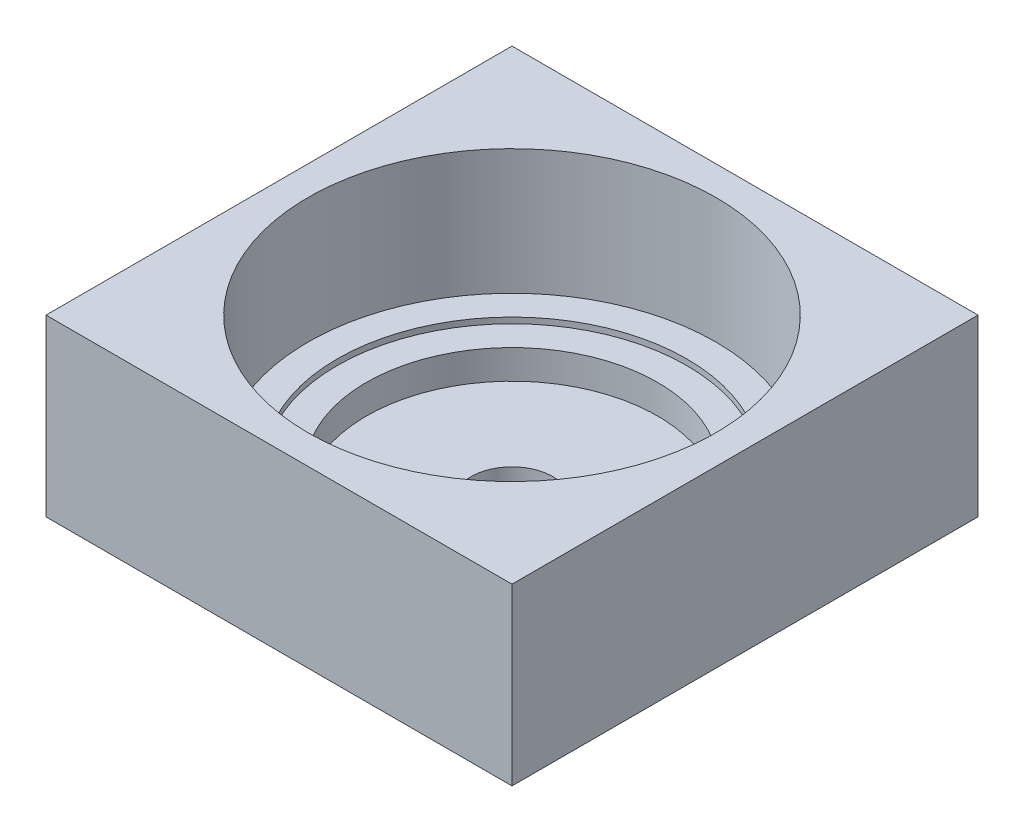
ISO-10303-21;
HEADER;
FILE_DESCRIPTION(('STEP AP214'),'2;1');
FILE_NAME('part.step','',(''),(''),'','','');
FILE_SCHEMA(('AUTOMOTIVE_DESIGN { 1 0 10303 214 1 1 1 1 }'));
ENDSEC;
DATA;
#1=APPLICATION_CONTEXT('core data for automotive mechanical design processes');
#2=APPLICATION_PROTOCOL_DEFINITION('international standard','automotive_design',2000,#1);
#3=PRODUCT_CONTEXT('',#1,'mechanical');
#4=PRODUCT('Part','Part','',(#3));
#5=PRODUCT_RELATED_PRODUCT_CATEGORY('part','',(#4));
#6=PRODUCT_DEFINITION_FORMATION('','',#4);
#7=PRODUCT_DEFINITION_CONTEXT('part definition',#1,'design');
#8=PRODUCT_DEFINITION('design','',#6,#7);
#9=PRODUCT_DEFINITION_SHAPE('','',#8);
#10=(LENGTH_UNIT() NAMED_UNIT(*) SI_UNIT(.MILLI.,.METRE.));
#11=(NAMED_UNIT(*) PLANE_ANGLE_UNIT() SI_UNIT($,.RADIAN.));
#12=(NAMED_UNIT(*) SI_UNIT($,.STERADIAN.) SOLID_ANGLE_UNIT());
#13=UNCERTAINTY_MEASURE_WITH_UNIT(LENGTH_MEASURE(1.E-05),#10,'distance_accuracy_value','');
#14=(GEOMETRIC_REPRESENTATION_CONTEXT(3) GLOBAL_UNCERTAINTY_ASSIGNED_CONTEXT((#13)) GLOBAL_UNIT_ASSIGNED_CONTEXT((#10,
#11,#12)) REPRESENTATION_CONTEXT('',''));
#15=CARTESIAN_POINT('',(0.,0.,0.));
#16=DIRECTION('',(0.,0.,1.));
#17=DIRECTION('',(1.,0.,0.));
#18=AXIS2_PLACEMENT_3D('',#15,#16,#17);
#19=CARTESIAN_POINT('',(80.,60.,80.));
#20=DIRECTION('',(-1.,0.,0.));
#21=DIRECTION('',(0.,0.,1.));
#22=AXIS2_PLACEMENT_3D('',#19,#20,#21);
#23=PLANE('',#22);
#24=DIRECTION('',(0.,0.,-1.));
#25=VECTOR('',#24,1.);
#26=CARTESIAN_POINT('',(80.,0.,80.));
#27=LINE('',#26,#25);
#28=CARTESIAN_POINT('',(80.,0.,80.));
#29=VERTEX_POINT('',#28);
#30=CARTESIAN_POINT('',(80.,0.,-80.));
#31=VERTEX_POINT('',#30);
#32=EDGE_CURVE('E96',#29,#31,#27,.T.);
#33=ORIENTED_EDGE('',*,*,#32,.T.);
#34=DIRECTION('',(0.,-1.,0.));
#35=VECTOR('',#34,1.);
#36=CARTESIAN_POINT('',(80.,60.,-80.));
#37=LINE('',#36,#35);
#38=CARTESIAN_POINT('',(80.,60.,-80.));
#39=VERTEX_POINT('',#38);
#40=EDGE_CURVE('E11',#39,#31,#37,.T.);
#41=ORIENTED_EDGE('',*,*,#40,.F.);
#42=DIRECTION('',(0.,0.,-1.));
#43=VECTOR('',#42,1.);
#44=CARTESIAN_POINT('',(80.,60.,80.));
#45=LINE('',#44,#43);
#46=CARTESIAN_POINT('',(80.,60.,80.));
#47=VERTEX_POINT('',#46);
#48=EDGE_CURVE('E84',#47,#39,#45,.T.);
#49=ORIENTED_EDGE('',*,*,#48,.F.);
#50=DIRECTION('',(0.,-1.,0.));
#51=VECTOR('',#50,1.);
#52=CARTESIAN_POINT('',(80.,60.,80.));
#53=LINE('',#52,#51);
#54=EDGE_CURVE('E92',#47,#29,#53,.T.);
#55=ORIENTED_EDGE('',*,*,#54,.T.);
#56=EDGE_LOOP('',(#33,#41,#49,#55));
#57=FACE_BOUND('',#56,.T.);
#58=ADVANCED_FACE('F33',(#57),#23,.F.);
#59=CARTESIAN_POINT('',(-80.,60.,-80.));
#60=DIRECTION('',(0.,0.,1.));
#61=DIRECTION('',(1.,0.,0.));
#62=AXIS2_PLACEMENT_3D('',#59,#60,#61);
#63=PLANE('',#62);
#64=DIRECTION('',(-1.,0.,0.));
#65=VECTOR('',#64,1.);
#66=CARTESIAN_POINT('',(-80.,0.,-80.));
#67=LINE('',#66,#65);
#68=CARTESIAN_POINT('',(-80.,0.,-80.));
#69=VERTEX_POINT('',#68);
#70=EDGE_CURVE('E88',#31,#69,#67,.T.);
#71=ORIENTED_EDGE('',*,*,#70,.T.);
#72=DIRECTION('',(0.,-1.,0.));
#73=VECTOR('',#72,1.);
#74=CARTESIAN_POINT('',(-80.,60.,-80.));
#75=LINE('',#74,#73);
#76=CARTESIAN_POINT('',(-80.,60.,-80.));
#77=VERTEX_POINT('',#76);
#78=EDGE_CURVE('E41',#77,#69,#75,.T.);
#79=ORIENTED_EDGE('',*,*,#78,.F.);
#80=DIRECTION('',(-1.,0.,0.));
#81=VECTOR('',#80,1.);
#82=CARTESIAN_POINT('',(-80.,60.,-80.));
#83=LINE('',#82,#81);
#84=EDGE_CURVE('E79',#39,#77,#83,.T.);
#85=ORIENTED_EDGE('',*,*,#84,.F.);
#86=ORIENTED_EDGE('',*,*,#40,.T.);
#87=EDGE_LOOP('',(#71,#79,#85,#86));
#88=FACE_BOUND('',#87,.T.);
#89=ADVANCED_FACE('F87',(#88),#63,.F.);
#90=CARTESIAN_POINT('',(-80.,60.,80.));
#91=DIRECTION('',(1.,0.,0.));
#92=DIRECTION('',(0.,0.,-1.));
#93=AXIS2_PLACEMENT_3D('',#90,#91,#92);
#94=PLANE('',#93);
#95=DIRECTION('',(0.,0.,1.));
#96=VECTOR('',#95,1.);
#97=CARTESIAN_POINT('',(-80.,0.,80.));
#98=LINE('',#97,#96);
#99=CARTESIAN_POINT('',(-80.,0.,80.));
#100=VERTEX_POINT('',#99);
#101=EDGE_CURVE('E66',#69,#100,#98,.T.);
#102=ORIENTED_EDGE('',*,*,#101,.T.);
#103=DIRECTION('',(0.,-1.,0.));
#104=VECTOR('',#103,1.);
#105=CARTESIAN_POINT('',(-80.,60.,80.));
#106=LINE('',#105,#104);
#107=CARTESIAN_POINT('',(-80.,60.,80.));
#108=VERTEX_POINT('',#107);
#109=EDGE_CURVE('E89',#108,#100,#106,.T.);
#110=ORIENTED_EDGE('',*,*,#109,.F.);
#111=DIRECTION('',(0.,0.,1.));
#112=VECTOR('',#111,1.);
#113=CARTESIAN_POINT('',(-80.,60.,80.));
#114=LINE('',#113,#112);
#115=EDGE_CURVE('E82',#77,#108,#114,.T.);
#116=ORIENTED_EDGE('',*,*,#115,.F.);
#117=ORIENTED_EDGE('',*,*,#78,.T.);
#118=EDGE_LOOP('',(#102,#110,#116,#117));
#119=FACE_BOUND('',#118,.T.);
#120=ADVANCED_FACE('F90',(#119),#94,.F.);
#121=CARTESIAN_POINT('',(-80.,60.,80.));
#122=DIRECTION('',(0.,0.,-1.));
#123=DIRECTION('',(-1.,0.,0.));
#124=AXIS2_PLACEMENT_3D('',#121,#122,#123);
#125=PLANE('',#124);
#126=DIRECTION('',(1.,0.,0.));
#127=VECTOR('',#126,1.);
#128=CARTESIAN_POINT('',(-80.,0.,80.));
#129=LINE('',#128,#127);
#130=EDGE_CURVE('E72',#100,#29,#129,.T.);
#131=ORIENTED_EDGE('',*,*,#130,.T.);
#132=ORIENTED_EDGE('',*,*,#54,.F.);
#133=DIRECTION('',(1.,0.,0.));
#134=VECTOR('',#133,1.);
#135=CARTESIAN_POINT('',(-80.,60.,80.));
#136=LINE('',#135,#134);
#137=EDGE_CURVE('E49',#108,#47,#136,.T.);
#138=ORIENTED_EDGE('',*,*,#137,.F.);
#139=ORIENTED_EDGE('',*,*,#109,.T.);
#140=EDGE_LOOP('',(#131,#132,#138,#139));
#141=FACE_BOUND('',#140,.T.);
#142=ADVANCED_FACE('F104',(#141),#125,.F.);
#143=CARTESIAN_POINT('',(0.,60.,0.));
#144=DIRECTION('',(0.,-1.,0.));
#145=DIRECTION('',(0.,0.,-1.));
#146=AXIS2_PLACEMENT_3D('',#143,#144,#145);
#147=PLANE('',#146);
#148=CARTESIAN_POINT('',(0.,60.,0.));
#149=DIRECTION('',(0.,1.,0.));
#150=DIRECTION('',(0.,0.,1.));
#151=AXIS2_PLACEMENT_3D('',#148,#149,#150);
#152=CIRCLE('',#151,70.);
#153=CARTESIAN_POINT('',(0.,60.,70.));
#154=VERTEX_POINT('',#153);
#155=EDGE_CURVE('E99',#154,#154,#152,.T.);
#156=ORIENTED_EDGE('',*,*,#155,.F.);
#157=EDGE_LOOP('',(#156));
#158=FACE_BOUND('',#157,.T.);
#159=ORIENTED_EDGE('',*,*,#48,.T.);
#160=ORIENTED_EDGE('',*,*,#84,.T.);
#161=ORIENTED_EDGE('',*,*,#115,.T.);
#162=ORIENTED_EDGE('',*,*,#137,.T.);
#163=EDGE_LOOP('',(#159,#160,#161,#162));
#164=FACE_BOUND('',#163,.T.);
#165=ADVANCED_FACE('F80',(#158,#164),#147,.F.);
#166=CARTESIAN_POINT('',(0.,0.,0.));
#167=DIRECTION('',(0.,-1.,0.));
#168=DIRECTION('',(0.,0.,-1.));
#169=AXIS2_PLACEMENT_3D('',#166,#167,#168);
#170=PLANE('',#169);
#171=CARTESIAN_POINT('',(0.,0.,0.));
#172=DIRECTION('',(0.,1.,0.));
#173=DIRECTION('',(0.,0.,1.));
#174=AXIS2_PLACEMENT_3D('',#171,#172,#173);
#175=CIRCLE('',#174,14.);
#176=CARTESIAN_POINT('',(0.,0.,14.));
#177=VERTEX_POINT('',#176);
#178=EDGE_CURVE('E130',#177,#177,#175,.T.);
#179=ORIENTED_EDGE('',*,*,#178,.T.);
#180=EDGE_LOOP('',(#179));
#181=FACE_BOUND('',#180,.T.);
#182=ORIENTED_EDGE('',*,*,#32,.F.);
#183=ORIENTED_EDGE('',*,*,#130,.F.);
#184=ORIENTED_EDGE('',*,*,#101,.F.);
#185=ORIENTED_EDGE('',*,*,#70,.F.);
#186=EDGE_LOOP('',(#182,#183,#184,#185));
#187=FACE_BOUND('',#186,.T.);
#188=ADVANCED_FACE('F107',(#181,#187),#170,.T.);
#189=CARTESIAN_POINT('',(0.,77.8894263390262,0.));
#190=DIRECTION('',(0.,1.,0.));
#191=DIRECTION('',(0.,0.,1.));
#192=AXIS2_PLACEMENT_3D('',#189,#190,#191);
#193=CYLINDRICAL_SURFACE('',#192,70.);
#194=ORIENTED_EDGE('',*,*,#155,.T.);
#195=EDGE_LOOP('',(#194));
#196=FACE_BOUND('',#195,.T.);
#197=CARTESIAN_POINT('',(0.,17.,0.));
#198=DIRECTION('',(0.,1.,0.));
#199=DIRECTION('',(0.,0.,1.));
#200=AXIS2_PLACEMENT_3D('',#197,#198,#199);
#201=CIRCLE('',#200,70.);
#202=CARTESIAN_POINT('',(0.,17.,70.));
#203=VERTEX_POINT('',#202);
#204=EDGE_CURVE('E112',#203,#203,#201,.T.);
#205=ORIENTED_EDGE('',*,*,#204,.F.);
#206=EDGE_LOOP('',(#205));
#207=FACE_BOUND('',#206,.T.);
#208=ADVANCED_FACE('F159',(#196,#207),#193,.F.);
#209=CARTESIAN_POINT('',(60.,17.,0.));
#210=DIRECTION('',(0.,1.,0.));
#211=DIRECTION('',(0.,0.,1.));
#212=AXIS2_PLACEMENT_3D('',#209,#210,#211);
#213=PLANE('',#212);
#214=ORIENTED_EDGE('',*,*,#204,.T.);
#215=EDGE_LOOP('',(#214));
#216=FACE_BOUND('',#215,.T.);
#217=CARTESIAN_POINT('',(0.,17.,0.));
#218=DIRECTION('',(0.,1.,0.));
#219=DIRECTION('',(0.,0.,1.));
#220=AXIS2_PLACEMENT_3D('',#217,#218,#219);
#221=CIRCLE('',#220,60.);
#222=CARTESIAN_POINT('',(0.,17.,60.));
#223=VERTEX_POINT('',#222);
#224=EDGE_CURVE('E115',#223,#223,#221,.T.);
#225=ORIENTED_EDGE('',*,*,#224,.F.);
#226=EDGE_LOOP('',(#225));
#227=FACE_BOUND('',#226,.T.);
#228=ADVANCED_FACE('F165',(#216,#227),#213,.T.);
#229=CARTESIAN_POINT('',(0.,77.8894263390262,0.));
#230=DIRECTION('',(0.,1.,0.));
#231=DIRECTION('',(0.,0.,1.));
#232=AXIS2_PLACEMENT_3D('',#229,#230,#231);
#233=CYLINDRICAL_SURFACE('',#232,60.);
#234=ORIENTED_EDGE('',*,*,#224,.T.);
#235=EDGE_LOOP('',(#234));
#236=FACE_BOUND('',#235,.T.);
#237=CARTESIAN_POINT('',(0.,15.,0.));
#238=DIRECTION('',(0.,1.,0.));
#239=DIRECTION('',(0.,0.,1.));
#240=AXIS2_PLACEMENT_3D('',#237,#238,#239);
#241=CIRCLE('',#240,60.);
#242=CARTESIAN_POINT('',(0.,15.,60.));
#243=VERTEX_POINT('',#242);
#244=EDGE_CURVE('E118',#243,#243,#241,.T.);
#245=ORIENTED_EDGE('',*,*,#244,.F.);
#246=EDGE_LOOP('',(#245));
#247=FACE_BOUND('',#246,.T.);
#248=ADVANCED_FACE('F169',(#236,#247),#233,.F.);
#249=CARTESIAN_POINT('',(50.,15.,0.));
#250=DIRECTION('',(0.,1.,0.));
#251=DIRECTION('',(0.,0.,1.));
#252=AXIS2_PLACEMENT_3D('',#249,#250,#251);
#253=PLANE('',#252);
#254=ORIENTED_EDGE('',*,*,#244,.T.);
#255=EDGE_LOOP('',(#254));
#256=FACE_BOUND('',#255,.T.);
#257=CARTESIAN_POINT('',(0.,15.,0.));
#258=DIRECTION('',(0.,1.,0.));
#259=DIRECTION('',(0.,0.,1.));
#260=AXIS2_PLACEMENT_3D('',#257,#258,#259);
#261=CIRCLE('',#260,50.);
#262=CARTESIAN_POINT('',(0.,15.,50.));
#263=VERTEX_POINT('',#262);
#264=EDGE_CURVE('E121',#263,#263,#261,.T.);
#265=ORIENTED_EDGE('',*,*,#264,.F.);
#266=EDGE_LOOP('',(#265));
#267=FACE_BOUND('',#266,.T.);
#268=ADVANCED_FACE('F173',(#256,#267),#253,.T.);
#269=CARTESIAN_POINT('',(0.,77.8894263390262,0.));
#270=DIRECTION('',(0.,1.,0.));
#271=DIRECTION('',(0.,0.,1.));
#272=AXIS2_PLACEMENT_3D('',#269,#270,#271);
#273=CYLINDRICAL_SURFACE('',#272,50.);
#274=ORIENTED_EDGE('',*,*,#264,.T.);
#275=EDGE_LOOP('',(#274));
#276=FACE_BOUND('',#275,.T.);
#277=CARTESIAN_POINT('',(0.,5.,0.));
#278=DIRECTION('',(0.,1.,0.));
#279=DIRECTION('',(0.,0.,1.));
#280=AXIS2_PLACEMENT_3D('',#277,#278,#279);
#281=CIRCLE('',#280,50.);
#282=CARTESIAN_POINT('',(0.,5.,50.));
#283=VERTEX_POINT('',#282);
#284=EDGE_CURVE('E124',#283,#283,#281,.T.);
#285=ORIENTED_EDGE('',*,*,#284,.F.);
#286=EDGE_LOOP('',(#285));
#287=FACE_BOUND('',#286,.T.);
#288=ADVANCED_FACE('F143',(#276,#287),#273,.F.);
#289=CARTESIAN_POINT('',(14.,5.00000000000001,0.));
#290=DIRECTION('',(0.,1.,0.));
#291=DIRECTION('',(0.,0.,1.));
#292=AXIS2_PLACEMENT_3D('',#289,#290,#291);
#293=PLANE('',#292);
#294=ORIENTED_EDGE('',*,*,#284,.T.);
#295=EDGE_LOOP('',(#294));
#296=FACE_BOUND('',#295,.T.);
#297=CARTESIAN_POINT('',(0.,5.,0.));
#298=DIRECTION('',(0.,1.,0.));
#299=DIRECTION('',(0.,0.,1.));
#300=AXIS2_PLACEMENT_3D('',#297,#298,#299);
#301=CIRCLE('',#300,14.);
#302=CARTESIAN_POINT('',(0.,5.,14.));
#303=VERTEX_POINT('',#302);
#304=EDGE_CURVE('E127',#303,#303,#301,.T.);
#305=ORIENTED_EDGE('',*,*,#304,.F.);
#306=EDGE_LOOP('',(#305));
#307=FACE_BOUND('',#306,.T.);
#308=ADVANCED_FACE('F137',(#296,#307),#293,.T.);
#309=CARTESIAN_POINT('',(0.,77.8894263390262,0.));
#310=DIRECTION('',(0.,1.,0.));
#311=DIRECTION('',(0.,0.,1.));
#312=AXIS2_PLACEMENT_3D('',#309,#310,#311);
#313=CYLINDRICAL_SURFACE('',#312,14.);
#314=ORIENTED_EDGE('',*,*,#304,.T.);
#315=EDGE_LOOP('',(#314));
#316=FACE_BOUND('',#315,.T.);
#317=ORIENTED_EDGE('',*,*,#178,.F.);
#318=EDGE_LOOP('',(#317));
#319=FACE_BOUND('',#318,.T.);
#320=ADVANCED_FACE('F135',(#316,#319),#313,.F.);
#321=CLOSED_SHELL('',(#58,#89,#120,#142,#165,#188,#208,#228,#248,#268,#288,#308,#320));
#322=MANIFOLD_SOLID_BREP('B2',#321);
#323=ADVANCED_BREP_SHAPE_REPRESENTATION('',(#18,#322),#14);
#324=SHAPE_DEFINITION_REPRESENTATION(#9,#323);
ENDSEC;
END-ISO-10303-21;
